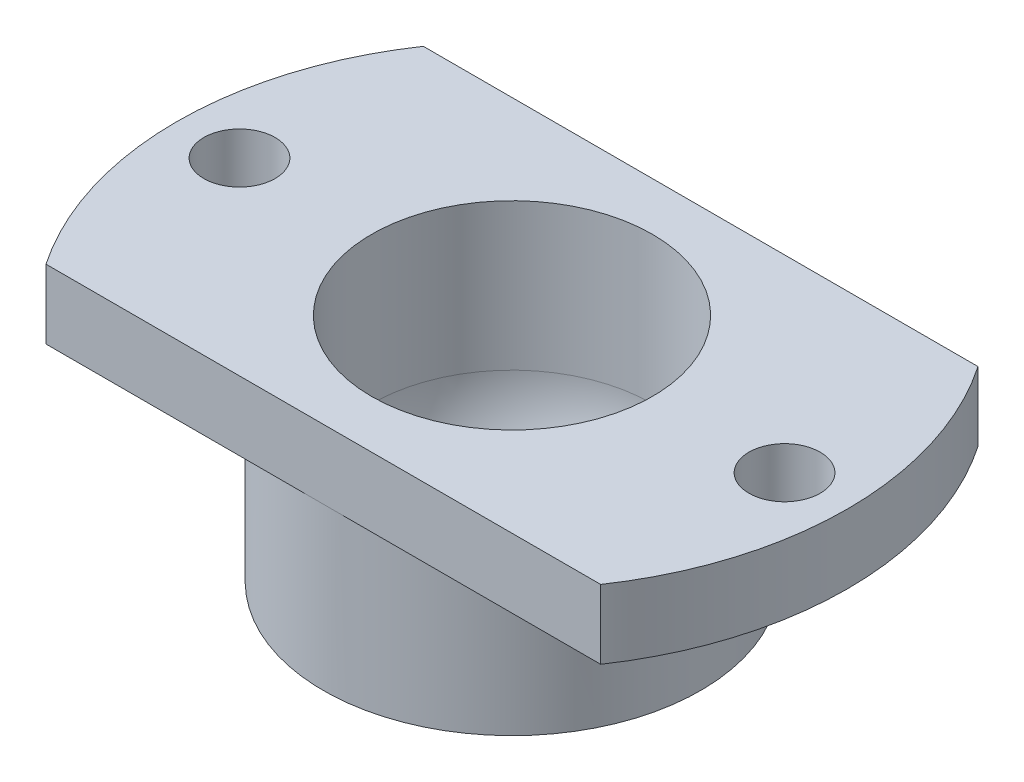
ISO-10303-21;
HEADER;
FILE_DESCRIPTION(('STEP AP214'),'2;1');
FILE_NAME('part.step','',(''),(''),'','','');
FILE_SCHEMA(('AUTOMOTIVE_DESIGN { 1 0 10303 214 1 1 1 1 }'));
ENDSEC;
DATA;
#1=APPLICATION_CONTEXT('core data for automotive mechanical design processes');
#2=APPLICATION_PROTOCOL_DEFINITION('international standard','automotive_design',2000,#1);
#3=PRODUCT_CONTEXT('',#1,'mechanical');
#4=PRODUCT('Part','Part','',(#3));
#5=PRODUCT_RELATED_PRODUCT_CATEGORY('part','',(#4));
#6=PRODUCT_DEFINITION_FORMATION('','',#4);
#7=PRODUCT_DEFINITION_CONTEXT('part definition',#1,'design');
#8=PRODUCT_DEFINITION('design','',#6,#7);
#9=PRODUCT_DEFINITION_SHAPE('','',#8);
#10=(LENGTH_UNIT() NAMED_UNIT(*) SI_UNIT(.MILLI.,.METRE.));
#11=(NAMED_UNIT(*) PLANE_ANGLE_UNIT() SI_UNIT($,.RADIAN.));
#12=(NAMED_UNIT(*) SI_UNIT($,.STERADIAN.) SOLID_ANGLE_UNIT());
#13=UNCERTAINTY_MEASURE_WITH_UNIT(LENGTH_MEASURE(1.E-05),#10,'distance_accuracy_value','');
#14=(GEOMETRIC_REPRESENTATION_CONTEXT(3) GLOBAL_UNCERTAINTY_ASSIGNED_CONTEXT((#13)) GLOBAL_UNIT_ASSIGNED_CONTEXT((#10,
#11,#12)) REPRESENTATION_CONTEXT('',''));
#15=CARTESIAN_POINT('',(0.,0.,0.));
#16=DIRECTION('',(0.,0.,1.));
#17=DIRECTION('',(1.,0.,0.));
#18=AXIS2_PLACEMENT_3D('',#15,#16,#17);
#19=CARTESIAN_POINT('',(0.,7.,0.));
#20=DIRECTION('',(0.,1.,0.));
#21=DIRECTION('',(0.,0.,1.));
#22=AXIS2_PLACEMENT_3D('',#19,#20,#21);
#23=PLANE('',#22);
#24=CARTESIAN_POINT('',(13.,7.,0.));
#25=DIRECTION('',(0.,1.,0.));
#26=DIRECTION('',(0.,0.,1.));
#27=AXIS2_PLACEMENT_3D('',#24,#25,#26);
#28=CIRCLE('',#27,1.7);
#29=CARTESIAN_POINT('',(13.,7.,1.7));
#30=VERTEX_POINT('',#29);
#31=EDGE_CURVE('E256',#30,#30,#28,.T.);
#32=ORIENTED_EDGE('',*,*,#31,.F.);
#33=EDGE_LOOP('',(#32));
#34=FACE_BOUND('',#33,.T.);
#35=CARTESIAN_POINT('',(-13.,7.,0.));
#36=DIRECTION('',(0.,1.,0.));
#37=DIRECTION('',(0.,0.,1.));
#38=AXIS2_PLACEMENT_3D('',#35,#36,#37);
#39=CIRCLE('',#38,1.7);
#40=CARTESIAN_POINT('',(-13.,7.,1.7));
#41=VERTEX_POINT('',#40);
#42=EDGE_CURVE('E262',#41,#41,#39,.T.);
#43=ORIENTED_EDGE('',*,*,#42,.F.);
#44=EDGE_LOOP('',(#43));
#45=FACE_BOUND('',#44,.T.);
#46=CARTESIAN_POINT('',(0.,7.,0.));
#47=DIRECTION('',(0.,-1.,0.));
#48=DIRECTION('',(0.,0.,-1.));
#49=AXIS2_PLACEMENT_3D('',#46,#47,#48);
#50=CIRCLE('',#49,6.7);
#51=CARTESIAN_POINT('',(0.,7.,-6.7));
#52=VERTEX_POINT('',#51);
#53=EDGE_CURVE('E47',#52,#52,#50,.T.);
#54=ORIENTED_EDGE('',*,*,#53,.T.);
#55=EDGE_LOOP('',(#54));
#56=FACE_BOUND('',#55,.T.);
#57=CARTESIAN_POINT('',(0.,7.,0.));
#58=DIRECTION('',(0.,-1.,0.));
#59=DIRECTION('',(0.,0.,-1.));
#60=AXIS2_PLACEMENT_3D('',#57,#58,#59);
#61=CIRCLE('',#60,16.);
#62=CARTESIAN_POINT('',(-13.228756555323,7.,9.));
#63=VERTEX_POINT('',#62);
#64=CARTESIAN_POINT('',(-13.228756555323,7.,-9.));
#65=VERTEX_POINT('',#64);
#66=EDGE_CURVE('E106',#63,#65,#61,.T.);
#67=ORIENTED_EDGE('',*,*,#66,.F.);
#68=DIRECTION('',(-1.,0.,0.));
#69=VECTOR('',#68,1.);
#70=CARTESIAN_POINT('',(-17.0763099120146,7.,9.));
#71=LINE('',#70,#69);
#72=CARTESIAN_POINT('',(13.228756555323,7.,9.));
#73=VERTEX_POINT('',#72);
#74=EDGE_CURVE('E249',#73,#63,#71,.T.);
#75=ORIENTED_EDGE('',*,*,#74,.F.);
#76=CARTESIAN_POINT('',(13.228756555323,7.,-9.));
#77=VERTEX_POINT('',#76);
#78=EDGE_CURVE('E101',#77,#73,#61,.T.);
#79=ORIENTED_EDGE('',*,*,#78,.F.);
#80=DIRECTION('',(1.,0.,0.));
#81=VECTOR('',#80,1.);
#82=CARTESIAN_POINT('',(-17.0763099120146,7.,-9.));
#83=LINE('',#82,#81);
#84=EDGE_CURVE('E92',#65,#77,#83,.T.);
#85=ORIENTED_EDGE('',*,*,#84,.F.);
#86=EDGE_LOOP('',(#67,#75,#79,#85));
#87=FACE_BOUND('',#86,.T.);
#88=ADVANCED_FACE('F39',(#34,#45,#56,#87),#23,.T.);
#89=CARTESIAN_POINT('',(0.,0.,0.));
#90=DIRECTION('',(0.,-1.,0.));
#91=DIRECTION('',(0.,0.,-1.));
#92=AXIS2_PLACEMENT_3D('',#89,#90,#91);
#93=CYLINDRICAL_SURFACE('',#92,16.);
#94=DIRECTION('',(0.,-1.,0.));
#95=VECTOR('',#94,1.);
#96=CARTESIAN_POINT('',(-13.228756555323,0.,9.));
#97=LINE('',#96,#95);
#98=CARTESIAN_POINT('',(-13.228756555323,3.7,9.));
#99=VERTEX_POINT('',#98);
#100=EDGE_CURVE('E102',#63,#99,#97,.T.);
#101=ORIENTED_EDGE('',*,*,#100,.F.);
#102=ORIENTED_EDGE('',*,*,#66,.T.);
#103=DIRECTION('',(0.,-1.,0.));
#104=VECTOR('',#103,1.);
#105=CARTESIAN_POINT('',(-13.228756555323,0.,-9.));
#106=LINE('',#105,#104);
#107=CARTESIAN_POINT('',(-13.228756555323,3.7,-9.));
#108=VERTEX_POINT('',#107);
#109=EDGE_CURVE('E247',#108,#65,#106,.F.);
#110=ORIENTED_EDGE('',*,*,#109,.F.);
#111=CARTESIAN_POINT('',(0.,3.7,0.));
#112=DIRECTION('',(0.,-1.,0.));
#113=DIRECTION('',(0.,0.,-1.));
#114=AXIS2_PLACEMENT_3D('',#111,#112,#113);
#115=CIRCLE('',#114,16.);
#116=EDGE_CURVE('E107',#99,#108,#115,.T.);
#117=ORIENTED_EDGE('',*,*,#116,.F.);
#118=EDGE_LOOP('',(#101,#102,#110,#117));
#119=FACE_BOUND('',#118,.T.);
#120=ADVANCED_FACE('F136',(#119),#93,.T.);
#121=DIRECTION('',(0.,-1.,0.));
#122=VECTOR('',#121,1.);
#123=CARTESIAN_POINT('',(13.228756555323,0.,9.));
#124=LINE('',#123,#122);
#125=CARTESIAN_POINT('',(13.228756555323,3.7,9.));
#126=VERTEX_POINT('',#125);
#127=EDGE_CURVE('E86',#126,#73,#124,.F.);
#128=ORIENTED_EDGE('',*,*,#127,.F.);
#129=CARTESIAN_POINT('',(13.228756555323,3.7,-9.));
#130=VERTEX_POINT('',#129);
#131=EDGE_CURVE('E99',#130,#126,#115,.T.);
#132=ORIENTED_EDGE('',*,*,#131,.F.);
#133=DIRECTION('',(0.,-1.,0.));
#134=VECTOR('',#133,1.);
#135=CARTESIAN_POINT('',(13.228756555323,0.,-9.));
#136=LINE('',#135,#134);
#137=EDGE_CURVE('E103',#77,#130,#136,.T.);
#138=ORIENTED_EDGE('',*,*,#137,.F.);
#139=ORIENTED_EDGE('',*,*,#78,.T.);
#140=EDGE_LOOP('',(#128,#132,#138,#139));
#141=FACE_BOUND('',#140,.T.);
#142=ADVANCED_FACE('F97',(#141),#93,.T.);
#143=CARTESIAN_POINT('',(0.,3.7,0.));
#144=DIRECTION('',(0.,1.,0.));
#145=DIRECTION('',(0.,0.,1.));
#146=AXIS2_PLACEMENT_3D('',#143,#144,#145);
#147=PLANE('',#146);
#148=CARTESIAN_POINT('',(-13.,3.7,0.));
#149=DIRECTION('',(0.,-1.,0.));
#150=DIRECTION('',(0.,0.,-1.));
#151=AXIS2_PLACEMENT_3D('',#148,#149,#150);
#152=CIRCLE('',#151,1.7);
#153=CARTESIAN_POINT('',(-13.,3.7,-1.7));
#154=VERTEX_POINT('',#153);
#155=EDGE_CURVE('E259',#154,#154,#152,.T.);
#156=ORIENTED_EDGE('',*,*,#155,.F.);
#157=EDGE_LOOP('',(#156));
#158=FACE_BOUND('',#157,.T.);
#159=DIRECTION('',(-1.,0.,0.));
#160=VECTOR('',#159,1.);
#161=CARTESIAN_POINT('',(-17.0763099120146,3.7,9.));
#162=LINE('',#161,#160);
#163=CARTESIAN_POINT('',(0.,3.7,9.));
#164=VERTEX_POINT('',#163);
#165=EDGE_CURVE('E54',#164,#99,#162,.T.);
#166=ORIENTED_EDGE('',*,*,#165,.T.);
#167=ORIENTED_EDGE('',*,*,#116,.T.);
#168=DIRECTION('',(1.,0.,0.));
#169=VECTOR('',#168,1.);
#170=CARTESIAN_POINT('',(-17.0763099120146,3.7,-9.));
#171=LINE('',#170,#169);
#172=CARTESIAN_POINT('',(0.,3.7,-9.));
#173=VERTEX_POINT('',#172);
#174=EDGE_CURVE('E276',#108,#173,#171,.T.);
#175=ORIENTED_EDGE('',*,*,#174,.T.);
#176=CARTESIAN_POINT('',(0.,3.7,0.));
#177=DIRECTION('',(0.,-1.,0.));
#178=DIRECTION('',(0.,0.,-1.));
#179=AXIS2_PLACEMENT_3D('',#176,#177,#178);
#180=CIRCLE('',#179,9.);
#181=EDGE_CURVE('E268',#164,#173,#180,.T.);
#182=ORIENTED_EDGE('',*,*,#181,.F.);
#183=EDGE_LOOP('',(#166,#167,#175,#182));
#184=FACE_BOUND('',#183,.T.);
#185=ADVANCED_FACE('F131',(#158,#184),#147,.F.);
#186=CARTESIAN_POINT('',(13.,3.7,0.));
#187=DIRECTION('',(0.,-1.,0.));
#188=DIRECTION('',(0.,0.,-1.));
#189=AXIS2_PLACEMENT_3D('',#186,#187,#188);
#190=CIRCLE('',#189,1.7);
#191=CARTESIAN_POINT('',(13.,3.7,-1.7));
#192=VERTEX_POINT('',#191);
#193=EDGE_CURVE('E253',#192,#192,#190,.T.);
#194=ORIENTED_EDGE('',*,*,#193,.F.);
#195=EDGE_LOOP('',(#194));
#196=FACE_BOUND('',#195,.T.);
#197=EDGE_CURVE('E83',#126,#164,#162,.T.);
#198=ORIENTED_EDGE('',*,*,#197,.T.);
#199=EDGE_CURVE('E112',#173,#164,#180,.T.);
#200=ORIENTED_EDGE('',*,*,#199,.F.);
#201=EDGE_CURVE('E62',#173,#130,#171,.T.);
#202=ORIENTED_EDGE('',*,*,#201,.T.);
#203=ORIENTED_EDGE('',*,*,#131,.T.);
#204=EDGE_LOOP('',(#198,#200,#202,#203));
#205=FACE_BOUND('',#204,.T.);
#206=ADVANCED_FACE('F105',(#196,#205),#147,.F.);
#207=CARTESIAN_POINT('',(0.,0.,0.));
#208=DIRECTION('',(0.,-1.,0.));
#209=DIRECTION('',(0.,0.,1.));
#210=AXIS2_PLACEMENT_3D('',#207,#208,#209);
#211=SPHERICAL_SURFACE('',#210,6.7);
#212=CARTESIAN_POINT('',(0.,-4.,0.));
#213=DIRECTION('',(0.,-1.,0.));
#214=DIRECTION('',(0.,0.,-1.));
#215=AXIS2_PLACEMENT_3D('',#212,#213,#214);
#216=CIRCLE('',#215,5.37494186015068);
#217=CARTESIAN_POINT('',(0.,-4.,-5.37494186015068));
#218=VERTEX_POINT('',#217);
#219=EDGE_CURVE('E265',#218,#218,#216,.T.);
#220=ORIENTED_EDGE('',*,*,#219,.T.);
#221=EDGE_LOOP('',(#220));
#222=FACE_BOUND('',#221,.T.);
#223=CARTESIAN_POINT('',(0.,0.,0.));
#224=DIRECTION('',(0.,-1.,0.));
#225=DIRECTION('',(0.,0.,-1.));
#226=AXIS2_PLACEMENT_3D('',#223,#224,#225);
#227=CIRCLE('',#226,6.7);
#228=CARTESIAN_POINT('',(0.,0.,-6.7));
#229=VERTEX_POINT('',#228);
#230=EDGE_CURVE('E11',#229,#229,#227,.T.);
#231=ORIENTED_EDGE('',*,*,#230,.F.);
#232=EDGE_LOOP('',(#231));
#233=FACE_BOUND('',#232,.T.);
#234=ADVANCED_FACE('F41',(#222,#233),#211,.F.);
#235=CARTESIAN_POINT('',(0.,0.,0.));
#236=DIRECTION('',(0.,-1.,0.));
#237=DIRECTION('',(0.,0.,-1.));
#238=AXIS2_PLACEMENT_3D('',#235,#236,#237);
#239=CYLINDRICAL_SURFACE('',#238,6.7);
#240=ORIENTED_EDGE('',*,*,#53,.F.);
#241=EDGE_LOOP('',(#240));
#242=FACE_BOUND('',#241,.T.);
#243=ORIENTED_EDGE('',*,*,#230,.T.);
#244=EDGE_LOOP('',(#243));
#245=FACE_BOUND('',#244,.T.);
#246=ADVANCED_FACE('F120',(#242,#245),#239,.F.);
#247=CARTESIAN_POINT('',(0.,0.,0.));
#248=DIRECTION('',(0.,-1.,0.));
#249=DIRECTION('',(0.,0.,-1.));
#250=AXIS2_PLACEMENT_3D('',#247,#248,#249);
#251=CYLINDRICAL_SURFACE('',#250,9.);
#252=ORIENTED_EDGE('',*,*,#199,.T.);
#253=ORIENTED_EDGE('',*,*,#181,.T.);
#254=EDGE_LOOP('',(#252,#253));
#255=FACE_BOUND('',#254,.T.);
#256=CARTESIAN_POINT('',(0.,-4.,0.));
#257=DIRECTION('',(0.,-1.,0.));
#258=DIRECTION('',(0.,0.,-1.));
#259=AXIS2_PLACEMENT_3D('',#256,#257,#258);
#260=CIRCLE('',#259,9.);
#261=CARTESIAN_POINT('',(0.,-4.,-9.));
#262=VERTEX_POINT('',#261);
#263=EDGE_CURVE('E266',#262,#262,#260,.T.);
#264=ORIENTED_EDGE('',*,*,#263,.F.);
#265=EDGE_LOOP('',(#264));
#266=FACE_BOUND('',#265,.T.);
#267=ADVANCED_FACE('F123',(#255,#266),#251,.T.);
#268=CARTESIAN_POINT('',(0.,-4.,0.));
#269=DIRECTION('',(0.,1.,0.));
#270=DIRECTION('',(0.,0.,1.));
#271=AXIS2_PLACEMENT_3D('',#268,#269,#270);
#272=PLANE('',#271);
#273=ORIENTED_EDGE('',*,*,#219,.F.);
#274=EDGE_LOOP('',(#273));
#275=FACE_BOUND('',#274,.T.);
#276=ORIENTED_EDGE('',*,*,#263,.T.);
#277=EDGE_LOOP('',(#276));
#278=FACE_BOUND('',#277,.T.);
#279=ADVANCED_FACE('F151',(#275,#278),#272,.F.);
#280=CARTESIAN_POINT('',(-13.,3.7,0.));
#281=DIRECTION('',(0.,-1.,0.));
#282=DIRECTION('',(0.,0.,-1.));
#283=AXIS2_PLACEMENT_3D('',#280,#281,#282);
#284=CYLINDRICAL_SURFACE('',#283,1.7);
#285=ORIENTED_EDGE('',*,*,#42,.T.);
#286=EDGE_LOOP('',(#285));
#287=FACE_BOUND('',#286,.T.);
#288=ORIENTED_EDGE('',*,*,#155,.T.);
#289=EDGE_LOOP('',(#288));
#290=FACE_BOUND('',#289,.T.);
#291=ADVANCED_FACE('F155',(#287,#290),#284,.F.);
#292=CARTESIAN_POINT('',(13.,3.7,0.));
#293=DIRECTION('',(0.,-1.,0.));
#294=DIRECTION('',(0.,0.,-1.));
#295=AXIS2_PLACEMENT_3D('',#292,#293,#294);
#296=CYLINDRICAL_SURFACE('',#295,1.7);
#297=ORIENTED_EDGE('',*,*,#31,.T.);
#298=EDGE_LOOP('',(#297));
#299=FACE_BOUND('',#298,.T.);
#300=ORIENTED_EDGE('',*,*,#193,.T.);
#301=EDGE_LOOP('',(#300));
#302=FACE_BOUND('',#301,.T.);
#303=ADVANCED_FACE('F159',(#299,#302),#296,.F.);
#304=CARTESIAN_POINT('',(-17.0763099120146,7.,-9.));
#305=DIRECTION('',(0.,0.,-1.));
#306=DIRECTION('',(-1.,0.,0.));
#307=AXIS2_PLACEMENT_3D('',#304,#305,#306);
#308=PLANE('',#307);
#309=ORIENTED_EDGE('',*,*,#137,.T.);
#310=ORIENTED_EDGE('',*,*,#201,.F.);
#311=ORIENTED_EDGE('',*,*,#174,.F.);
#312=ORIENTED_EDGE('',*,*,#109,.T.);
#313=ORIENTED_EDGE('',*,*,#84,.T.);
#314=EDGE_LOOP('',(#309,#310,#311,#312,#313));
#315=FACE_BOUND('',#314,.T.);
#316=ADVANCED_FACE('F163',(#315),#308,.T.);
#317=CARTESIAN_POINT('',(-17.0763099120146,7.,9.));
#318=DIRECTION('',(0.,0.,1.));
#319=DIRECTION('',(1.,0.,0.));
#320=AXIS2_PLACEMENT_3D('',#317,#318,#319);
#321=PLANE('',#320);
#322=ORIENTED_EDGE('',*,*,#100,.T.);
#323=ORIENTED_EDGE('',*,*,#165,.F.);
#324=ORIENTED_EDGE('',*,*,#197,.F.);
#325=ORIENTED_EDGE('',*,*,#127,.T.);
#326=ORIENTED_EDGE('',*,*,#74,.T.);
#327=EDGE_LOOP('',(#322,#323,#324,#325,#326));
#328=FACE_BOUND('',#327,.T.);
#329=ADVANCED_FACE('F85',(#328),#321,.T.);
#330=CLOSED_SHELL('',(#88,#120,#142,#185,#206,#234,#246,#267,#279,#291,#303,#316,#329));
#331=MANIFOLD_SOLID_BREP('B2',#330);
#332=ADVANCED_BREP_SHAPE_REPRESENTATION('',(#18,#331),#14);
#333=SHAPE_DEFINITION_REPRESENTATION(#9,#332);
ENDSEC;
END-ISO-10303-21;
